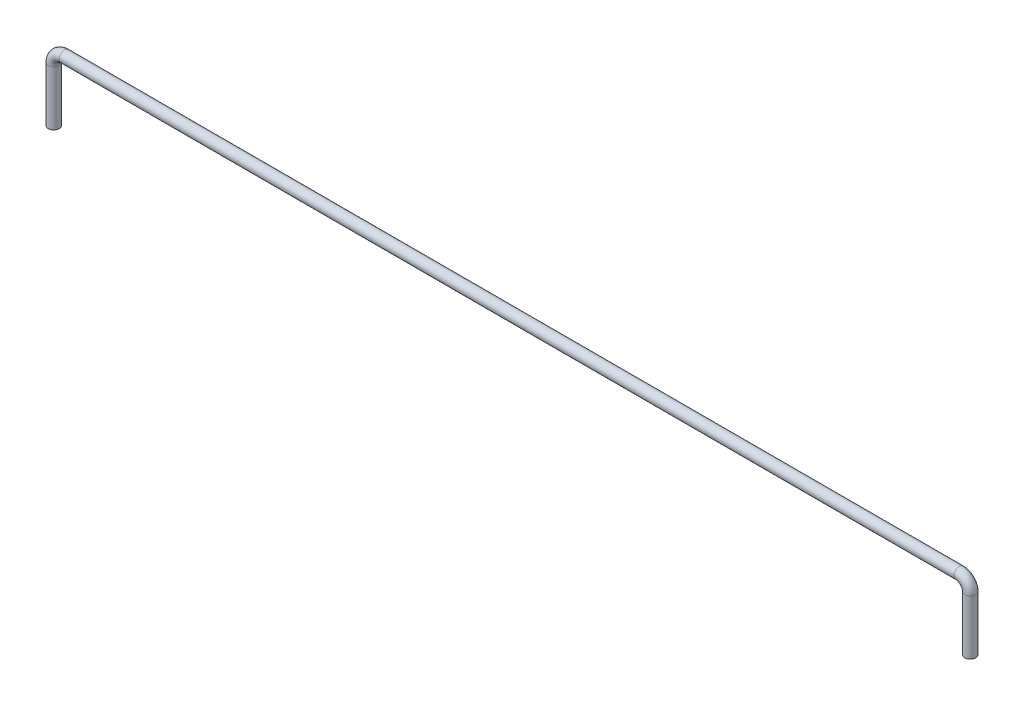
ISO-10303-21;
HEADER;
FILE_DESCRIPTION(('STEP AP214'),'2;1');
FILE_NAME('part.step','',(''),(''),'','','');
FILE_SCHEMA(('AUTOMOTIVE_DESIGN { 1 0 10303 214 1 1 1 1 }'));
ENDSEC;
DATA;
#1=APPLICATION_CONTEXT('core data for automotive mechanical design processes');
#2=APPLICATION_PROTOCOL_DEFINITION('international standard','automotive_design',2000,#1);
#3=PRODUCT_CONTEXT('',#1,'mechanical');
#4=PRODUCT('Part','Part','',(#3));
#5=PRODUCT_RELATED_PRODUCT_CATEGORY('part','',(#4));
#6=PRODUCT_DEFINITION_FORMATION('','',#4);
#7=PRODUCT_DEFINITION_CONTEXT('part definition',#1,'design');
#8=PRODUCT_DEFINITION('design','',#6,#7);
#9=PRODUCT_DEFINITION_SHAPE('','',#8);
#10=(LENGTH_UNIT() NAMED_UNIT(*) SI_UNIT(.MILLI.,.METRE.));
#11=(NAMED_UNIT(*) PLANE_ANGLE_UNIT() SI_UNIT($,.RADIAN.));
#12=(NAMED_UNIT(*) SI_UNIT($,.STERADIAN.) SOLID_ANGLE_UNIT());
#13=UNCERTAINTY_MEASURE_WITH_UNIT(LENGTH_MEASURE(1.E-05),#10,'distance_accuracy_value','');
#14=(GEOMETRIC_REPRESENTATION_CONTEXT(3) GLOBAL_UNCERTAINTY_ASSIGNED_CONTEXT((#13)) GLOBAL_UNIT_ASSIGNED_CONTEXT((#10,
#11,#12)) REPRESENTATION_CONTEXT('',''));
#15=CARTESIAN_POINT('',(0.,0.,0.));
#16=DIRECTION('',(0.,0.,1.));
#17=DIRECTION('',(1.,0.,0.));
#18=AXIS2_PLACEMENT_3D('',#15,#16,#17);
#19=CARTESIAN_POINT('',(0.,2.,0.));
#20=DIRECTION('',(0.,-1.,0.));
#21=DIRECTION('',(0.,0.,-1.));
#22=AXIS2_PLACEMENT_3D('',#19,#20,#21);
#23=CYLINDRICAL_SURFACE('',#22,0.25);
#24=CARTESIAN_POINT('',(0.,0.,0.));
#25=DIRECTION('',(0.,1.,0.));
#26=DIRECTION('',(0.,0.,1.));
#27=AXIS2_PLACEMENT_3D('',#24,#25,#26);
#28=CIRCLE('',#27,0.25);
#29=CARTESIAN_POINT('',(0.,0.,0.25));
#30=VERTEX_POINT('',#29);
#31=EDGE_CURVE('E10',#30,#30,#28,.T.);
#32=ORIENTED_EDGE('',*,*,#31,.T.);
#33=EDGE_LOOP('',(#32));
#34=FACE_BOUND('',#33,.T.);
#35=CARTESIAN_POINT('',(0.,2.5,0.));
#36=DIRECTION('',(0.,1.,0.));
#37=DIRECTION('',(0.,0.,1.));
#38=AXIS2_PLACEMENT_3D('',#35,#36,#37);
#39=CIRCLE('',#38,0.25);
#40=CARTESIAN_POINT('',(-0.25,2.5,0.));
#41=VERTEX_POINT('',#40);
#42=EDGE_CURVE('E68',#41,#41,#39,.T.);
#43=ORIENTED_EDGE('',*,*,#42,.F.);
#44=EDGE_LOOP('',(#43));
#45=FACE_BOUND('',#44,.T.);
#46=ADVANCED_FACE('F41',(#34,#45),#23,.T.);
#47=CARTESIAN_POINT('',(0.,0.,0.));
#48=DIRECTION('',(0.,1.,0.));
#49=DIRECTION('',(0.,0.,1.));
#50=AXIS2_PLACEMENT_3D('',#47,#48,#49);
#51=PLANE('',#50);
#52=ORIENTED_EDGE('',*,*,#31,.F.);
#53=EDGE_LOOP('',(#52));
#54=FACE_BOUND('',#53,.T.);
#55=ADVANCED_FACE('F76',(#54),#51,.F.);
#56=CARTESIAN_POINT('',(41.9,0.,0.));
#57=DIRECTION('',(0.,-1.,0.));
#58=DIRECTION('',(0.,0.,1.));
#59=AXIS2_PLACEMENT_3D('',#56,#57,#58);
#60=PLANE('',#59);
#61=CARTESIAN_POINT('',(41.9,0.,0.));
#62=DIRECTION('',(0.,-1.,0.));
#63=DIRECTION('',(0.,0.,1.));
#64=AXIS2_PLACEMENT_3D('',#61,#62,#63);
#65=CIRCLE('',#64,0.25);
#66=CARTESIAN_POINT('',(41.9,0.,0.25));
#67=VERTEX_POINT('',#66);
#68=EDGE_CURVE('E48',#67,#67,#65,.T.);
#69=ORIENTED_EDGE('',*,*,#68,.T.);
#70=EDGE_LOOP('',(#69));
#71=FACE_BOUND('',#70,.T.);
#72=ADVANCED_FACE('F80',(#71),#60,.T.);
#73=CARTESIAN_POINT('',(0.5,2.5,0.));
#74=DIRECTION('',(0.,0.,-1.));
#75=DIRECTION('',(-1.,0.,0.));
#76=AXIS2_PLACEMENT_3D('',#73,#74,#75);
#77=TOROIDAL_SURFACE('',#76,0.5,0.25);
#78=CARTESIAN_POINT('',(0.5,3.,0.));
#79=DIRECTION('',(1.,0.,0.));
#80=DIRECTION('',(0.,0.,1.));
#81=AXIS2_PLACEMENT_3D('',#78,#79,#80);
#82=CIRCLE('',#81,0.25);
#83=CARTESIAN_POINT('',(0.5,3.25,0.));
#84=VERTEX_POINT('',#83);
#85=EDGE_CURVE('E64',#84,#84,#82,.T.);
#86=CARTESIAN_POINT('',(0.5,2.5,0.));
#87=DIRECTION('',(0.,0.,-1.));
#88=DIRECTION('',(-1.,0.,0.));
#89=AXIS2_PLACEMENT_3D('',#86,#87,#88);
#90=CIRCLE('',#89,0.75);
#91=EDGE_CURVE('',#41,#84,#90,.T.);
#92=ORIENTED_EDGE('',*,*,#42,.T.);
#93=ORIENTED_EDGE('',*,*,#85,.F.);
#94=ORIENTED_EDGE('',*,*,#91,.T.);
#95=ORIENTED_EDGE('',*,*,#91,.F.);
#96=EDGE_LOOP('',(#92,#94,#93,#95));
#97=FACE_BOUND('',#96,.T.);
#98=ADVANCED_FACE('F73',(#97),#77,.T.);
#99=CARTESIAN_POINT('',(0.5,3.,0.));
#100=DIRECTION('',(1.,0.,0.));
#101=DIRECTION('',(0.,1.,0.));
#102=AXIS2_PLACEMENT_3D('',#99,#100,#101);
#103=CYLINDRICAL_SURFACE('',#102,0.25);
#104=CARTESIAN_POINT('',(41.4,3.,0.));
#105=DIRECTION('',(1.,0.,0.));
#106=DIRECTION('',(0.,0.,1.));
#107=AXIS2_PLACEMENT_3D('',#104,#105,#106);
#108=CIRCLE('',#107,0.25);
#109=CARTESIAN_POINT('',(41.4,3.25,0.));
#110=VERTEX_POINT('',#109);
#111=EDGE_CURVE('E58',#110,#110,#108,.T.);
#112=ORIENTED_EDGE('',*,*,#111,.F.);
#113=EDGE_LOOP('',(#112));
#114=FACE_BOUND('',#113,.T.);
#115=ORIENTED_EDGE('',*,*,#85,.T.);
#116=EDGE_LOOP('',(#115));
#117=FACE_BOUND('',#116,.T.);
#118=ADVANCED_FACE('F94',(#114,#117),#103,.T.);
#119=CARTESIAN_POINT('',(41.4,2.5,0.));
#120=DIRECTION('',(0.,0.,-1.));
#121=DIRECTION('',(-1.,0.,0.));
#122=AXIS2_PLACEMENT_3D('',#119,#120,#121);
#123=TOROIDAL_SURFACE('',#122,0.500000000000004,0.25);
#124=CARTESIAN_POINT('',(41.9,2.5,0.));
#125=DIRECTION('',(0.,-1.,0.));
#126=DIRECTION('',(0.,0.,1.));
#127=AXIS2_PLACEMENT_3D('',#124,#125,#126);
#128=CIRCLE('',#127,0.25);
#129=CARTESIAN_POINT('',(42.15,2.5,0.));
#130=VERTEX_POINT('',#129);
#131=EDGE_CURVE('E53',#130,#130,#128,.T.);
#132=CARTESIAN_POINT('',(41.4,2.5,0.));
#133=DIRECTION('',(0.,0.,-1.));
#134=DIRECTION('',(-1.,0.,0.));
#135=AXIS2_PLACEMENT_3D('',#132,#133,#134);
#136=CIRCLE('',#135,0.750000000000004);
#137=EDGE_CURVE('',#110,#130,#136,.T.);
#138=ORIENTED_EDGE('',*,*,#111,.T.);
#139=ORIENTED_EDGE('',*,*,#131,.F.);
#140=ORIENTED_EDGE('',*,*,#137,.T.);
#141=ORIENTED_EDGE('',*,*,#137,.F.);
#142=EDGE_LOOP('',(#138,#140,#139,#141));
#143=FACE_BOUND('',#142,.T.);
#144=ADVANCED_FACE('F88',(#143),#123,.T.);
#145=CARTESIAN_POINT('',(41.9,2.5,0.));
#146=DIRECTION('',(0.,-1.,0.));
#147=DIRECTION('',(1.,0.,0.));
#148=AXIS2_PLACEMENT_3D('',#145,#146,#147);
#149=CYLINDRICAL_SURFACE('',#148,0.25);
#150=ORIENTED_EDGE('',*,*,#68,.F.);
#151=EDGE_LOOP('',(#150));
#152=FACE_BOUND('',#151,.T.);
#153=ORIENTED_EDGE('',*,*,#131,.T.);
#154=EDGE_LOOP('',(#153));
#155=FACE_BOUND('',#154,.T.);
#156=ADVANCED_FACE('F82',(#152,#155),#149,.T.);
#157=CLOSED_SHELL('',(#46,#55,#72,#98,#118,#144,#156));
#158=MANIFOLD_SOLID_BREP('B2',#157);
#159=ADVANCED_BREP_SHAPE_REPRESENTATION('',(#18,#158),#14);
#160=SHAPE_DEFINITION_REPRESENTATION(#9,#159);
ENDSEC;
END-ISO-10303-21;
